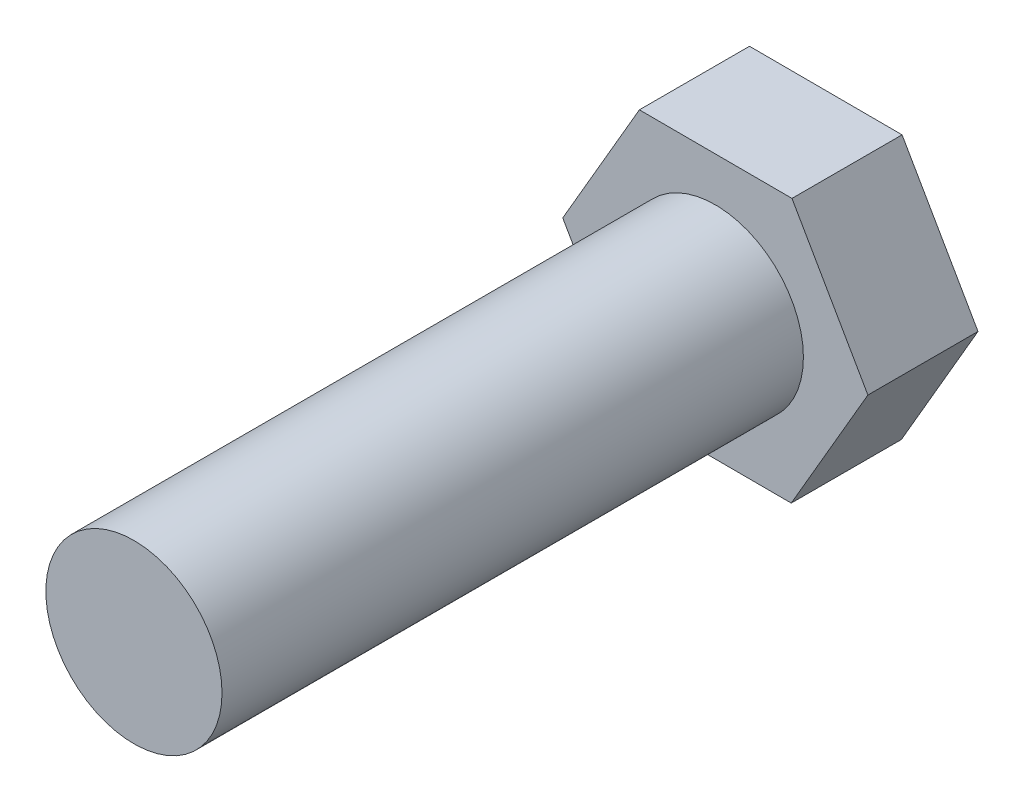
ISO-10303-21;
HEADER;
FILE_DESCRIPTION(('STEP AP214'),'2;1');
FILE_NAME('part.step','',(''),(''),'','','');
FILE_SCHEMA(('AUTOMOTIVE_DESIGN { 1 0 10303 214 1 1 1 1 }'));
ENDSEC;
DATA;
#1=APPLICATION_CONTEXT('core data for automotive mechanical design processes');
#2=APPLICATION_PROTOCOL_DEFINITION('international standard','automotive_design',2000,#1);
#3=PRODUCT_CONTEXT('',#1,'mechanical');
#4=PRODUCT('Part','Part','',(#3));
#5=PRODUCT_RELATED_PRODUCT_CATEGORY('part','',(#4));
#6=PRODUCT_DEFINITION_FORMATION('','',#4);
#7=PRODUCT_DEFINITION_CONTEXT('part definition',#1,'design');
#8=PRODUCT_DEFINITION('design','',#6,#7);
#9=PRODUCT_DEFINITION_SHAPE('','',#8);
#10=(LENGTH_UNIT() NAMED_UNIT(*) SI_UNIT(.MILLI.,.METRE.));
#11=(NAMED_UNIT(*) PLANE_ANGLE_UNIT() SI_UNIT($,.RADIAN.));
#12=(NAMED_UNIT(*) SI_UNIT($,.STERADIAN.) SOLID_ANGLE_UNIT());
#13=UNCERTAINTY_MEASURE_WITH_UNIT(LENGTH_MEASURE(1.E-05),#10,'distance_accuracy_value','');
#14=(GEOMETRIC_REPRESENTATION_CONTEXT(3) GLOBAL_UNCERTAINTY_ASSIGNED_CONTEXT((#13)) GLOBAL_UNIT_ASSIGNED_CONTEXT((#10,
#11,#12)) REPRESENTATION_CONTEXT('',''));
#15=CARTESIAN_POINT('',(0.,0.,0.));
#16=DIRECTION('',(0.,0.,1.));
#17=DIRECTION('',(1.,0.,0.));
#18=AXIS2_PLACEMENT_3D('',#15,#16,#17);
#19=CARTESIAN_POINT('',(-5.52532137742304,-9.50990660712249,7.9375));
#20=DIRECTION('',(0.0027381289632032,0.999996251317864,0.));
#21=DIRECTION('',(-0.999996251317864,0.0027381289632032,0.));
#22=AXIS2_PLACEMENT_3D('',#19,#20,#21);
#23=PLANE('',#22);
#24=DIRECTION('',(0.999996251317864,-0.0027381289632032,0.));
#25=VECTOR('',#24,1.);
#26=CARTESIAN_POINT('',(-5.52532137742304,-9.50990660712249,0.));
#27=LINE('',#26,#25);
#28=CARTESIAN_POINT('',(-5.52532137742304,-9.50990660712249,0.));
#29=VERTEX_POINT('',#28);
#30=CARTESIAN_POINT('',(5.47316002067403,-9.54002198048283,0.));
#31=VERTEX_POINT('',#30);
#32=EDGE_CURVE('E120',#29,#31,#27,.T.);
#33=ORIENTED_EDGE('',*,*,#32,.T.);
#34=DIRECTION('',(0.,0.,-1.));
#35=VECTOR('',#34,1.);
#36=CARTESIAN_POINT('',(5.47316002067403,-9.54002198048283,7.9375));
#37=LINE('',#36,#35);
#38=CARTESIAN_POINT('',(5.47316002067403,-9.54002198048283,7.9375));
#39=VERTEX_POINT('',#38);
#40=EDGE_CURVE('E37',#39,#31,#37,.T.);
#41=ORIENTED_EDGE('',*,*,#40,.F.);
#42=DIRECTION('',(0.999996251317864,-0.0027381289632032,0.));
#43=VECTOR('',#42,1.);
#44=CARTESIAN_POINT('',(-5.52532137742304,-9.50990660712249,7.9375));
#45=LINE('',#44,#43);
#46=CARTESIAN_POINT('',(-5.52532137742304,-9.50990660712249,7.9375));
#47=VERTEX_POINT('',#46);
#48=EDGE_CURVE('E131',#47,#39,#45,.T.);
#49=ORIENTED_EDGE('',*,*,#48,.F.);
#50=DIRECTION('',(0.,0.,-1.));
#51=VECTOR('',#50,1.);
#52=CARTESIAN_POINT('',(-5.52532137742304,-9.50990660712249,7.9375));
#53=LINE('',#52,#51);
#54=EDGE_CURVE('E116',#47,#29,#53,.T.);
#55=ORIENTED_EDGE('',*,*,#54,.T.);
#56=EDGE_LOOP('',(#33,#41,#49,#55));
#57=FACE_BOUND('',#56,.T.);
#58=ADVANCED_FACE('F34',(#57),#23,.F.);
#59=CARTESIAN_POINT('',(5.47316002067403,-9.54002198048283,7.9375));
#60=DIRECTION('',(-0.864653092848876,0.502369414899905,0.));
#61=DIRECTION('',(-0.502369414899905,-0.864653092848876,0.));
#62=AXIS2_PLACEMENT_3D('',#59,#60,#61);
#63=PLANE('',#62);
#64=DIRECTION('',(0.502369414899905,0.864653092848876,0.));
#65=VECTOR('',#64,1.);
#66=CARTESIAN_POINT('',(5.47316002067403,-9.54002198048283,0.));
#67=LINE('',#66,#65);
#68=CARTESIAN_POINT('',(10.9984813980971,-0.0301153733603558,0.));
#69=VERTEX_POINT('',#68);
#70=EDGE_CURVE('E123',#31,#69,#67,.T.);
#71=ORIENTED_EDGE('',*,*,#70,.T.);
#72=DIRECTION('',(0.,0.,-1.));
#73=VECTOR('',#72,1.);
#74=CARTESIAN_POINT('',(10.9984813980971,-0.0301153733603558,7.9375));
#75=LINE('',#74,#73);
#76=CARTESIAN_POINT('',(10.9984813980971,-0.0301153733603558,7.9375));
#77=VERTEX_POINT('',#76);
#78=EDGE_CURVE('E134',#77,#69,#75,.T.);
#79=ORIENTED_EDGE('',*,*,#78,.F.);
#80=DIRECTION('',(0.502369414899905,0.864653092848876,0.));
#81=VECTOR('',#80,1.);
#82=CARTESIAN_POINT('',(5.47316002067403,-9.54002198048283,7.9375));
#83=LINE('',#82,#81);
#84=EDGE_CURVE('E89',#39,#77,#83,.T.);
#85=ORIENTED_EDGE('',*,*,#84,.F.);
#86=ORIENTED_EDGE('',*,*,#40,.T.);
#87=EDGE_LOOP('',(#71,#79,#85,#86));
#88=FACE_BOUND('',#87,.T.);
#89=ADVANCED_FACE('F139',(#88),#63,.F.);
#90=CARTESIAN_POINT('',(10.9984813980971,-0.0301153733603558,7.9375));
#91=DIRECTION('',(-0.86739122181208,-0.49762683641796,0.));
#92=DIRECTION('',(0.49762683641796,-0.86739122181208,0.));
#93=AXIS2_PLACEMENT_3D('',#90,#91,#92);
#94=PLANE('',#93);
#95=DIRECTION('',(-0.49762683641796,0.86739122181208,0.));
#96=VECTOR('',#95,1.);
#97=CARTESIAN_POINT('',(10.9984813980971,-0.0301153733603558,0.));
#98=LINE('',#97,#96);
#99=CARTESIAN_POINT('',(5.52532137742305,9.50990660712248,0.));
#100=VERTEX_POINT('',#99);
#101=EDGE_CURVE('E126',#69,#100,#98,.T.);
#102=ORIENTED_EDGE('',*,*,#101,.T.);
#103=DIRECTION('',(0.,0.,-1.));
#104=VECTOR('',#103,1.);
#105=CARTESIAN_POINT('',(5.52532137742305,9.50990660712248,7.9375));
#106=LINE('',#105,#104);
#107=CARTESIAN_POINT('',(5.52532137742305,9.50990660712248,7.9375));
#108=VERTEX_POINT('',#107);
#109=EDGE_CURVE('E111',#108,#100,#106,.T.);
#110=ORIENTED_EDGE('',*,*,#109,.F.);
#111=DIRECTION('',(-0.49762683641796,0.86739122181208,0.));
#112=VECTOR('',#111,1.);
#113=CARTESIAN_POINT('',(10.9984813980971,-0.0301153733603558,7.9375));
#114=LINE('',#113,#112);
#115=EDGE_CURVE('E102',#77,#108,#114,.T.);
#116=ORIENTED_EDGE('',*,*,#115,.F.);
#117=ORIENTED_EDGE('',*,*,#78,.T.);
#118=EDGE_LOOP('',(#102,#110,#116,#117));
#119=FACE_BOUND('',#118,.T.);
#120=ADVANCED_FACE('F145',(#119),#94,.F.);
#121=CARTESIAN_POINT('',(5.52532137742305,9.50990660712248,7.9375));
#122=DIRECTION('',(-0.00273812896320336,-0.999996251317864,0.));
#123=DIRECTION('',(0.999996251317864,-0.00273812896320336,0.));
#124=AXIS2_PLACEMENT_3D('',#121,#122,#123);
#125=PLANE('',#124);
#126=DIRECTION('',(-0.999996251317864,0.00273812896320336,0.));
#127=VECTOR('',#126,1.);
#128=CARTESIAN_POINT('',(5.52532137742305,9.50990660712248,0.));
#129=LINE('',#128,#127);
#130=CARTESIAN_POINT('',(-5.47316002067403,9.54002198048283,0.));
#131=VERTEX_POINT('',#130);
#132=EDGE_CURVE('E110',#100,#131,#129,.T.);
#133=ORIENTED_EDGE('',*,*,#132,.T.);
#134=DIRECTION('',(0.,0.,-1.));
#135=VECTOR('',#134,1.);
#136=CARTESIAN_POINT('',(-5.47316002067403,9.54002198048283,7.9375));
#137=LINE('',#136,#135);
#138=CARTESIAN_POINT('',(-5.47316002067403,9.54002198048283,7.9375));
#139=VERTEX_POINT('',#138);
#140=EDGE_CURVE('E107',#139,#131,#137,.T.);
#141=ORIENTED_EDGE('',*,*,#140,.F.);
#142=DIRECTION('',(-0.999996251317864,0.00273812896320336,0.));
#143=VECTOR('',#142,1.);
#144=CARTESIAN_POINT('',(5.52532137742305,9.50990660712248,7.9375));
#145=LINE('',#144,#143);
#146=EDGE_CURVE('E96',#108,#139,#145,.T.);
#147=ORIENTED_EDGE('',*,*,#146,.F.);
#148=ORIENTED_EDGE('',*,*,#109,.T.);
#149=EDGE_LOOP('',(#133,#141,#147,#148));
#150=FACE_BOUND('',#149,.T.);
#151=ADVANCED_FACE('F108',(#150),#125,.F.);
#152=CARTESIAN_POINT('',(-5.47316002067403,9.54002198048283,7.9375));
#153=DIRECTION('',(0.864653092848876,-0.502369414899905,0.));
#154=DIRECTION('',(0.502369414899905,0.864653092848876,0.));
#155=AXIS2_PLACEMENT_3D('',#152,#153,#154);
#156=PLANE('',#155);
#157=DIRECTION('',(-0.502369414899905,-0.864653092848876,0.));
#158=VECTOR('',#157,1.);
#159=CARTESIAN_POINT('',(-5.47316002067403,9.54002198048283,0.));
#160=LINE('',#159,#158);
#161=CARTESIAN_POINT('',(-10.9984813980971,0.0301153733603598,0.));
#162=VERTEX_POINT('',#161);
#163=EDGE_CURVE('E74',#131,#162,#160,.T.);
#164=ORIENTED_EDGE('',*,*,#163,.T.);
#165=DIRECTION('',(0.,0.,-1.));
#166=VECTOR('',#165,1.);
#167=CARTESIAN_POINT('',(-10.9984813980971,0.0301153733603598,7.9375));
#168=LINE('',#167,#166);
#169=CARTESIAN_POINT('',(-10.9984813980971,0.0301153733603598,7.9375));
#170=VERTEX_POINT('',#169);
#171=EDGE_CURVE('E112',#170,#162,#168,.T.);
#172=ORIENTED_EDGE('',*,*,#171,.F.);
#173=DIRECTION('',(-0.502369414899905,-0.864653092848876,0.));
#174=VECTOR('',#173,1.);
#175=CARTESIAN_POINT('',(-5.47316002067403,9.54002198048283,7.9375));
#176=LINE('',#175,#174);
#177=EDGE_CURVE('E100',#139,#170,#176,.T.);
#178=ORIENTED_EDGE('',*,*,#177,.F.);
#179=ORIENTED_EDGE('',*,*,#140,.T.);
#180=EDGE_LOOP('',(#164,#172,#178,#179));
#181=FACE_BOUND('',#180,.T.);
#182=ADVANCED_FACE('F114',(#181),#156,.F.);
#183=CARTESIAN_POINT('',(-10.9984813980971,0.0301153733603598,7.9375));
#184=DIRECTION('',(0.86739122181208,0.49762683641796,0.));
#185=DIRECTION('',(-0.49762683641796,0.86739122181208,0.));
#186=AXIS2_PLACEMENT_3D('',#183,#184,#185);
#187=PLANE('',#186);
#188=DIRECTION('',(0.49762683641796,-0.86739122181208,0.));
#189=VECTOR('',#188,1.);
#190=CARTESIAN_POINT('',(-10.9984813980971,0.0301153733603598,0.));
#191=LINE('',#190,#189);
#192=EDGE_CURVE('E80',#162,#29,#191,.T.);
#193=ORIENTED_EDGE('',*,*,#192,.T.);
#194=ORIENTED_EDGE('',*,*,#54,.F.);
#195=DIRECTION('',(0.49762683641796,-0.86739122181208,0.));
#196=VECTOR('',#195,1.);
#197=CARTESIAN_POINT('',(-10.9984813980971,0.0301153733603598,7.9375));
#198=LINE('',#197,#196);
#199=EDGE_CURVE('E51',#170,#47,#198,.T.);
#200=ORIENTED_EDGE('',*,*,#199,.F.);
#201=ORIENTED_EDGE('',*,*,#171,.T.);
#202=EDGE_LOOP('',(#193,#194,#200,#201));
#203=FACE_BOUND('',#202,.T.);
#204=ADVANCED_FACE('F161',(#203),#187,.F.);
#205=CARTESIAN_POINT('',(0.,0.,7.9375));
#206=DIRECTION('',(0.,0.,1.));
#207=DIRECTION('',(1.,0.,0.));
#208=AXIS2_PLACEMENT_3D('',#205,#206,#207);
#209=PLANE('',#208);
#210=CARTESIAN_POINT('',(0.,0.,7.9375));
#211=DIRECTION('',(0.,0.,1.));
#212=DIRECTION('',(1.,0.,0.));
#213=AXIS2_PLACEMENT_3D('',#210,#211,#212);
#214=CIRCLE('',#213,6.35);
#215=CARTESIAN_POINT('',(6.35,0.,7.9375));
#216=VERTEX_POINT('',#215);
#217=EDGE_CURVE('E11',#216,#216,#214,.T.);
#218=ORIENTED_EDGE('',*,*,#217,.F.);
#219=EDGE_LOOP('',(#218));
#220=FACE_BOUND('',#219,.T.);
#221=ORIENTED_EDGE('',*,*,#48,.T.);
#222=ORIENTED_EDGE('',*,*,#84,.T.);
#223=ORIENTED_EDGE('',*,*,#115,.T.);
#224=ORIENTED_EDGE('',*,*,#146,.T.);
#225=ORIENTED_EDGE('',*,*,#177,.T.);
#226=ORIENTED_EDGE('',*,*,#199,.T.);
#227=EDGE_LOOP('',(#221,#222,#223,#224,#225,#226));
#228=FACE_BOUND('',#227,.T.);
#229=ADVANCED_FACE('F98',(#220,#228),#209,.T.);
#230=CARTESIAN_POINT('',(0.,0.,0.));
#231=DIRECTION('',(0.,0.,1.));
#232=DIRECTION('',(1.,0.,0.));
#233=AXIS2_PLACEMENT_3D('',#230,#231,#232);
#234=PLANE('',#233);
#235=ORIENTED_EDGE('',*,*,#32,.F.);
#236=ORIENTED_EDGE('',*,*,#192,.F.);
#237=ORIENTED_EDGE('',*,*,#163,.F.);
#238=ORIENTED_EDGE('',*,*,#132,.F.);
#239=ORIENTED_EDGE('',*,*,#101,.F.);
#240=ORIENTED_EDGE('',*,*,#70,.F.);
#241=EDGE_LOOP('',(#235,#236,#237,#238,#239,#240));
#242=FACE_BOUND('',#241,.T.);
#243=ADVANCED_FACE('F144',(#242),#234,.F.);
#244=CARTESIAN_POINT('',(0.,0.,49.8475));
#245=DIRECTION('',(0.,0.,-1.));
#246=DIRECTION('',(-1.,0.,0.));
#247=AXIS2_PLACEMENT_3D('',#244,#245,#246);
#248=CYLINDRICAL_SURFACE('',#247,6.35);
#249=CARTESIAN_POINT('',(0.,0.,49.8475));
#250=DIRECTION('',(0.,0.,1.));
#251=DIRECTION('',(1.,0.,0.));
#252=AXIS2_PLACEMENT_3D('',#249,#250,#251);
#253=CIRCLE('',#252,6.35);
#254=CARTESIAN_POINT('',(6.35,0.,49.8475));
#255=VERTEX_POINT('',#254);
#256=EDGE_CURVE('E124',#255,#255,#253,.T.);
#257=ORIENTED_EDGE('',*,*,#256,.F.);
#258=EDGE_LOOP('',(#257));
#259=FACE_BOUND('',#258,.T.);
#260=ORIENTED_EDGE('',*,*,#217,.T.);
#261=EDGE_LOOP('',(#260));
#262=FACE_BOUND('',#261,.T.);
#263=ADVANCED_FACE('F154',(#259,#262),#248,.T.);
#264=CARTESIAN_POINT('',(0.,0.,49.8475));
#265=DIRECTION('',(0.,0.,1.));
#266=DIRECTION('',(1.,0.,0.));
#267=AXIS2_PLACEMENT_3D('',#264,#265,#266);
#268=PLANE('',#267);
#269=ORIENTED_EDGE('',*,*,#256,.T.);
#270=EDGE_LOOP('',(#269));
#271=FACE_BOUND('',#270,.T.);
#272=ADVANCED_FACE('F152',(#271),#268,.T.);
#273=CLOSED_SHELL('',(#58,#89,#120,#151,#182,#204,#229,#243,#263,#272));
#274=MANIFOLD_SOLID_BREP('B2',#273);
#275=ADVANCED_BREP_SHAPE_REPRESENTATION('',(#18,#274),#14);
#276=SHAPE_DEFINITION_REPRESENTATION(#9,#275);
ENDSEC;
END-ISO-10303-21;
